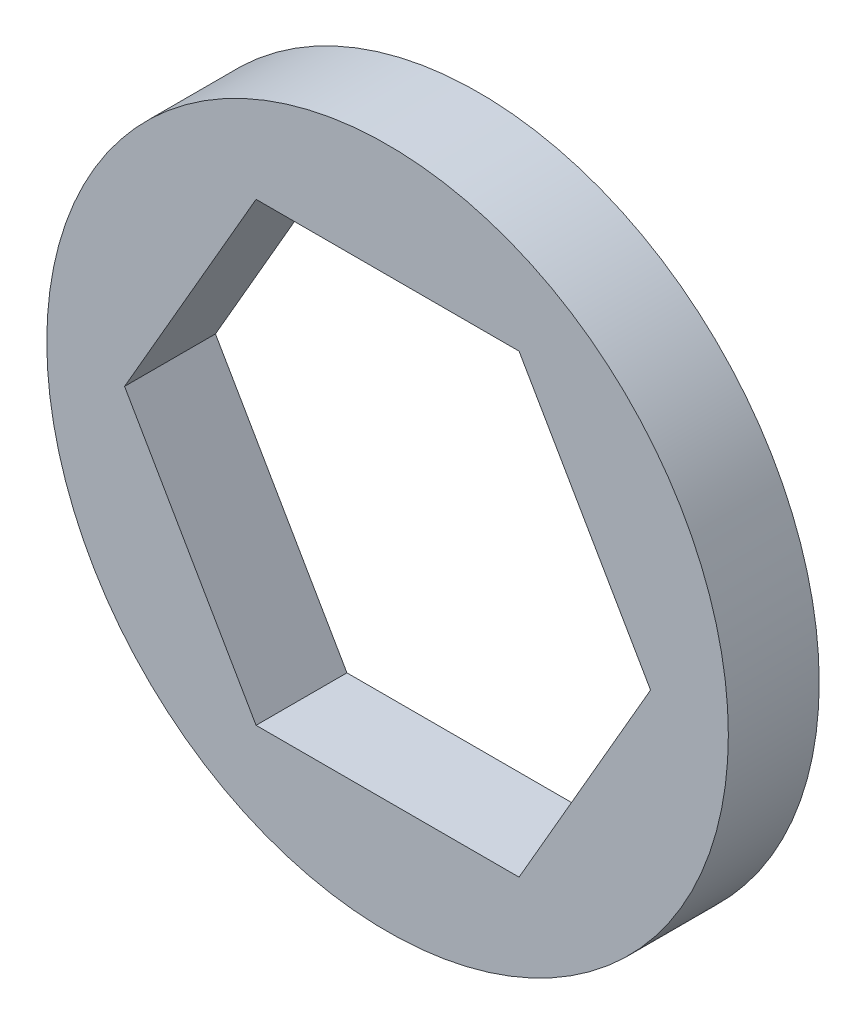
ISO-10303-21;
HEADER;
FILE_DESCRIPTION(('STEP AP214'),'2;1');
FILE_NAME('part.step','',(''),(''),'','','');
FILE_SCHEMA(('AUTOMOTIVE_DESIGN { 1 0 10303 214 1 1 1 1 }'));
ENDSEC;
DATA;
#1=APPLICATION_CONTEXT('core data for automotive mechanical design processes');
#2=APPLICATION_PROTOCOL_DEFINITION('international standard','automotive_design',2000,#1);
#3=PRODUCT_CONTEXT('',#1,'mechanical');
#4=PRODUCT('Part','Part','',(#3));
#5=PRODUCT_RELATED_PRODUCT_CATEGORY('part','',(#4));
#6=PRODUCT_DEFINITION_FORMATION('','',#4);
#7=PRODUCT_DEFINITION_CONTEXT('part definition',#1,'design');
#8=PRODUCT_DEFINITION('design','',#6,#7);
#9=PRODUCT_DEFINITION_SHAPE('','',#8);
#10=(LENGTH_UNIT() NAMED_UNIT(*) SI_UNIT(.MILLI.,.METRE.));
#11=(NAMED_UNIT(*) PLANE_ANGLE_UNIT() SI_UNIT($,.RADIAN.));
#12=(NAMED_UNIT(*) SI_UNIT($,.STERADIAN.) SOLID_ANGLE_UNIT());
#13=UNCERTAINTY_MEASURE_WITH_UNIT(LENGTH_MEASURE(1.E-05),#10,'distance_accuracy_value','');
#14=(GEOMETRIC_REPRESENTATION_CONTEXT(3) GLOBAL_UNCERTAINTY_ASSIGNED_CONTEXT((#13)) GLOBAL_UNIT_ASSIGNED_CONTEXT((#10,
#11,#12)) REPRESENTATION_CONTEXT('',''));
#15=CARTESIAN_POINT('',(0.,0.,0.));
#16=DIRECTION('',(0.,0.,1.));
#17=DIRECTION('',(1.,0.,0.));
#18=AXIS2_PLACEMENT_3D('',#15,#16,#17);
#19=CARTESIAN_POINT('',(0.,0.,1.));
#20=DIRECTION('',(0.,0.,1.));
#21=DIRECTION('',(1.,0.,0.));
#22=AXIS2_PLACEMENT_3D('',#19,#20,#21);
#23=PLANE('',#22);
#24=CARTESIAN_POINT('',(0.,0.,1.));
#25=DIRECTION('',(0.,0.,1.));
#26=DIRECTION('',(1.,0.,0.));
#27=AXIS2_PLACEMENT_3D('',#24,#25,#26);
#28=CIRCLE('',#27,7.5);
#29=CARTESIAN_POINT('',(7.5,0.,1.));
#30=VERTEX_POINT('',#29);
#31=EDGE_CURVE('E11',#30,#30,#28,.T.);
#32=ORIENTED_EDGE('',*,*,#31,.T.);
#33=EDGE_LOOP('',(#32));
#34=FACE_BOUND('',#33,.T.);
#35=DIRECTION('',(-0.5,0.866025403784438,0.));
#36=VECTOR('',#35,1.);
#37=CARTESIAN_POINT('',(5.787936448626,0.,1.));
#38=LINE('',#37,#36);
#39=CARTESIAN_POINT('',(5.787936448626,0.,1.));
#40=VERTEX_POINT('',#39);
#41=CARTESIAN_POINT('',(2.893968224313,5.0125,1.));
#42=VERTEX_POINT('',#41);
#43=EDGE_CURVE('E102',#40,#42,#38,.T.);
#44=ORIENTED_EDGE('',*,*,#43,.F.);
#45=DIRECTION('',(0.5,0.866025403784438,0.));
#46=VECTOR('',#45,1.);
#47=CARTESIAN_POINT('',(2.893968224313,-5.0125,1.));
#48=LINE('',#47,#46);
#49=CARTESIAN_POINT('',(2.893968224313,-5.0125,1.));
#50=VERTEX_POINT('',#49);
#51=EDGE_CURVE('E94',#50,#40,#48,.T.);
#52=ORIENTED_EDGE('',*,*,#51,.F.);
#53=DIRECTION('',(1.,0.,0.));
#54=VECTOR('',#53,1.);
#55=CARTESIAN_POINT('',(-2.893968224313,-5.0125,1.));
#56=LINE('',#55,#54);
#57=CARTESIAN_POINT('',(-2.893968224313,-5.0125,1.));
#58=VERTEX_POINT('',#57);
#59=EDGE_CURVE('E122',#58,#50,#56,.T.);
#60=ORIENTED_EDGE('',*,*,#59,.F.);
#61=DIRECTION('',(0.5,-0.866025403784439,0.));
#62=VECTOR('',#61,1.);
#63=CARTESIAN_POINT('',(-5.787936448626,0.,1.));
#64=LINE('',#63,#62);
#65=CARTESIAN_POINT('',(-5.787936448626,0.,1.));
#66=VERTEX_POINT('',#65);
#67=EDGE_CURVE('E120',#66,#58,#64,.T.);
#68=ORIENTED_EDGE('',*,*,#67,.F.);
#69=DIRECTION('',(-0.5,-0.866025403784438,0.));
#70=VECTOR('',#69,1.);
#71=CARTESIAN_POINT('',(-2.893968224313,5.0125,1.));
#72=LINE('',#71,#70);
#73=CARTESIAN_POINT('',(-2.893968224313,5.0125,1.));
#74=VERTEX_POINT('',#73);
#75=EDGE_CURVE('E116',#74,#66,#72,.T.);
#76=ORIENTED_EDGE('',*,*,#75,.F.);
#77=DIRECTION('',(-1.,0.,0.));
#78=VECTOR('',#77,1.);
#79=CARTESIAN_POINT('',(2.893968224313,5.0125,1.));
#80=LINE('',#79,#78);
#81=EDGE_CURVE('E114',#42,#74,#80,.T.);
#82=ORIENTED_EDGE('',*,*,#81,.F.);
#83=EDGE_LOOP('',(#44,#52,#60,#68,#76,#82));
#84=FACE_BOUND('',#83,.T.);
#85=ADVANCED_FACE('F41',(#34,#84),#23,.T.);
#86=CARTESIAN_POINT('',(0.,0.,-1.));
#87=DIRECTION('',(0.,0.,1.));
#88=DIRECTION('',(1.,0.,0.));
#89=AXIS2_PLACEMENT_3D('',#86,#87,#88);
#90=PLANE('',#89);
#91=CARTESIAN_POINT('',(0.,0.,-1.));
#92=DIRECTION('',(0.,0.,1.));
#93=DIRECTION('',(1.,0.,0.));
#94=AXIS2_PLACEMENT_3D('',#91,#92,#93);
#95=CIRCLE('',#94,7.5);
#96=CARTESIAN_POINT('',(7.5,0.,-1.));
#97=VERTEX_POINT('',#96);
#98=EDGE_CURVE('E45',#97,#97,#95,.T.);
#99=ORIENTED_EDGE('',*,*,#98,.F.);
#100=EDGE_LOOP('',(#99));
#101=FACE_BOUND('',#100,.T.);
#102=DIRECTION('',(0.5,0.866025403784438,0.));
#103=VECTOR('',#102,1.);
#104=CARTESIAN_POINT('',(2.893968224313,-5.0125,-1.));
#105=LINE('',#104,#103);
#106=CARTESIAN_POINT('',(2.893968224313,-5.0125,-1.));
#107=VERTEX_POINT('',#106);
#108=CARTESIAN_POINT('',(5.787936448626,0.,-1.));
#109=VERTEX_POINT('',#108);
#110=EDGE_CURVE('E64',#107,#109,#105,.T.);
#111=ORIENTED_EDGE('',*,*,#110,.T.);
#112=DIRECTION('',(-0.5,0.866025403784438,0.));
#113=VECTOR('',#112,1.);
#114=CARTESIAN_POINT('',(5.787936448626,0.,-1.));
#115=LINE('',#114,#113);
#116=CARTESIAN_POINT('',(2.893968224313,5.0125,-1.));
#117=VERTEX_POINT('',#116);
#118=EDGE_CURVE('E109',#109,#117,#115,.T.);
#119=ORIENTED_EDGE('',*,*,#118,.T.);
#120=DIRECTION('',(-1.,0.,0.));
#121=VECTOR('',#120,1.);
#122=CARTESIAN_POINT('',(2.893968224313,5.0125,-1.));
#123=LINE('',#122,#121);
#124=CARTESIAN_POINT('',(-2.893968224313,5.0125,-1.));
#125=VERTEX_POINT('',#124);
#126=EDGE_CURVE('E126',#117,#125,#123,.T.);
#127=ORIENTED_EDGE('',*,*,#126,.T.);
#128=DIRECTION('',(-0.5,-0.866025403784438,0.));
#129=VECTOR('',#128,1.);
#130=CARTESIAN_POINT('',(-2.893968224313,5.0125,-1.));
#131=LINE('',#130,#129);
#132=CARTESIAN_POINT('',(-5.787936448626,0.,-1.));
#133=VERTEX_POINT('',#132);
#134=EDGE_CURVE('E129',#125,#133,#131,.T.);
#135=ORIENTED_EDGE('',*,*,#134,.T.);
#136=DIRECTION('',(0.5,-0.866025403784439,0.));
#137=VECTOR('',#136,1.);
#138=CARTESIAN_POINT('',(-5.787936448626,0.,-1.));
#139=LINE('',#138,#137);
#140=CARTESIAN_POINT('',(-2.893968224313,-5.0125,-1.));
#141=VERTEX_POINT('',#140);
#142=EDGE_CURVE('E132',#133,#141,#139,.T.);
#143=ORIENTED_EDGE('',*,*,#142,.T.);
#144=DIRECTION('',(1.,0.,0.));
#145=VECTOR('',#144,1.);
#146=CARTESIAN_POINT('',(-2.893968224313,-5.0125,-1.));
#147=LINE('',#146,#145);
#148=EDGE_CURVE('E103',#141,#107,#147,.T.);
#149=ORIENTED_EDGE('',*,*,#148,.T.);
#150=EDGE_LOOP('',(#111,#119,#127,#135,#143,#149));
#151=FACE_BOUND('',#150,.T.);
#152=ADVANCED_FACE('F149',(#101,#151),#90,.F.);
#153=CARTESIAN_POINT('',(0.,0.,1.));
#154=DIRECTION('',(0.,0.,-1.));
#155=DIRECTION('',(-1.,0.,0.));
#156=AXIS2_PLACEMENT_3D('',#153,#154,#155);
#157=CYLINDRICAL_SURFACE('',#156,7.5);
#158=ORIENTED_EDGE('',*,*,#31,.F.);
#159=EDGE_LOOP('',(#158));
#160=FACE_BOUND('',#159,.T.);
#161=ORIENTED_EDGE('',*,*,#98,.T.);
#162=EDGE_LOOP('',(#161));
#163=FACE_BOUND('',#162,.T.);
#164=ADVANCED_FACE('F43',(#160,#163),#157,.T.);
#165=CARTESIAN_POINT('',(2.893968224313,-5.0125,1.));
#166=DIRECTION('',(-0.866025403784439,0.5,0.));
#167=DIRECTION('',(-0.5,-0.866025403784439,0.));
#168=AXIS2_PLACEMENT_3D('',#165,#166,#167);
#169=PLANE('',#168);
#170=ORIENTED_EDGE('',*,*,#110,.F.);
#171=DIRECTION('',(0.,0.,-1.));
#172=VECTOR('',#171,1.);
#173=CARTESIAN_POINT('',(2.893968224313,-5.0125,1.));
#174=LINE('',#173,#172);
#175=EDGE_CURVE('E98',#50,#107,#174,.T.);
#176=ORIENTED_EDGE('',*,*,#175,.F.);
#177=ORIENTED_EDGE('',*,*,#51,.T.);
#178=DIRECTION('',(0.,0.,-1.));
#179=VECTOR('',#178,1.);
#180=CARTESIAN_POINT('',(5.787936448626,0.,1.));
#181=LINE('',#180,#179);
#182=EDGE_CURVE('E97',#40,#109,#181,.T.);
#183=ORIENTED_EDGE('',*,*,#182,.T.);
#184=EDGE_LOOP('',(#170,#176,#177,#183));
#185=FACE_BOUND('',#184,.T.);
#186=ADVANCED_FACE('F96',(#185),#169,.T.);
#187=CARTESIAN_POINT('',(5.787936448626,0.,1.));
#188=DIRECTION('',(-0.866025403784438,-0.5,0.));
#189=DIRECTION('',(0.5,-0.866025403784439,0.));
#190=AXIS2_PLACEMENT_3D('',#187,#188,#189);
#191=PLANE('',#190);
#192=ORIENTED_EDGE('',*,*,#118,.F.);
#193=ORIENTED_EDGE('',*,*,#182,.F.);
#194=ORIENTED_EDGE('',*,*,#43,.T.);
#195=DIRECTION('',(0.,0.,-1.));
#196=VECTOR('',#195,1.);
#197=CARTESIAN_POINT('',(2.893968224313,5.0125,1.));
#198=LINE('',#197,#196);
#199=EDGE_CURVE('E110',#42,#117,#198,.T.);
#200=ORIENTED_EDGE('',*,*,#199,.T.);
#201=EDGE_LOOP('',(#192,#193,#194,#200));
#202=FACE_BOUND('',#201,.T.);
#203=ADVANCED_FACE('F106',(#202),#191,.T.);
#204=CARTESIAN_POINT('',(2.893968224313,5.0125,1.));
#205=DIRECTION('',(0.,-1.,0.));
#206=DIRECTION('',(1.,0.,0.));
#207=AXIS2_PLACEMENT_3D('',#204,#205,#206);
#208=PLANE('',#207);
#209=ORIENTED_EDGE('',*,*,#126,.F.);
#210=ORIENTED_EDGE('',*,*,#199,.F.);
#211=ORIENTED_EDGE('',*,*,#81,.T.);
#212=DIRECTION('',(0.,0.,-1.));
#213=VECTOR('',#212,1.);
#214=CARTESIAN_POINT('',(-2.893968224313,5.0125,1.));
#215=LINE('',#214,#213);
#216=EDGE_CURVE('E141',#74,#125,#215,.T.);
#217=ORIENTED_EDGE('',*,*,#216,.T.);
#218=EDGE_LOOP('',(#209,#210,#211,#217));
#219=FACE_BOUND('',#218,.T.);
#220=ADVANCED_FACE('F145',(#219),#208,.T.);
#221=CARTESIAN_POINT('',(-2.893968224313,5.0125,1.));
#222=DIRECTION('',(0.866025403784439,-0.5,0.));
#223=DIRECTION('',(0.5,0.866025403784439,0.));
#224=AXIS2_PLACEMENT_3D('',#221,#222,#223);
#225=PLANE('',#224);
#226=ORIENTED_EDGE('',*,*,#134,.F.);
#227=ORIENTED_EDGE('',*,*,#216,.F.);
#228=ORIENTED_EDGE('',*,*,#75,.T.);
#229=DIRECTION('',(0.,0.,-1.));
#230=VECTOR('',#229,1.);
#231=CARTESIAN_POINT('',(-5.787936448626,0.,1.));
#232=LINE('',#231,#230);
#233=EDGE_CURVE('E139',#66,#133,#232,.T.);
#234=ORIENTED_EDGE('',*,*,#233,.T.);
#235=EDGE_LOOP('',(#226,#227,#228,#234));
#236=FACE_BOUND('',#235,.T.);
#237=ADVANCED_FACE('F157',(#236),#225,.T.);
#238=CARTESIAN_POINT('',(-5.787936448626,0.,1.));
#239=DIRECTION('',(0.866025403784439,0.5,0.));
#240=DIRECTION('',(-0.5,0.866025403784439,0.));
#241=AXIS2_PLACEMENT_3D('',#238,#239,#240);
#242=PLANE('',#241);
#243=ORIENTED_EDGE('',*,*,#142,.F.);
#244=ORIENTED_EDGE('',*,*,#233,.F.);
#245=ORIENTED_EDGE('',*,*,#67,.T.);
#246=DIRECTION('',(0.,0.,-1.));
#247=VECTOR('',#246,1.);
#248=CARTESIAN_POINT('',(-2.893968224313,-5.0125,1.));
#249=LINE('',#248,#247);
#250=EDGE_CURVE('E56',#58,#141,#249,.T.);
#251=ORIENTED_EDGE('',*,*,#250,.T.);
#252=EDGE_LOOP('',(#243,#244,#245,#251));
#253=FACE_BOUND('',#252,.T.);
#254=ADVANCED_FACE('F155',(#253),#242,.T.);
#255=CARTESIAN_POINT('',(-2.893968224313,-5.0125,1.));
#256=DIRECTION('',(0.,1.,0.));
#257=DIRECTION('',(-1.,0.,0.));
#258=AXIS2_PLACEMENT_3D('',#255,#256,#257);
#259=PLANE('',#258);
#260=ORIENTED_EDGE('',*,*,#148,.F.);
#261=ORIENTED_EDGE('',*,*,#250,.F.);
#262=ORIENTED_EDGE('',*,*,#59,.T.);
#263=ORIENTED_EDGE('',*,*,#175,.T.);
#264=EDGE_LOOP('',(#260,#261,#262,#263));
#265=FACE_BOUND('',#264,.T.);
#266=ADVANCED_FACE('F151',(#265),#259,.T.);
#267=CLOSED_SHELL('',(#85,#152,#164,#186,#203,#220,#237,#254,#266));
#268=MANIFOLD_SOLID_BREP('B2',#267);
#269=ADVANCED_BREP_SHAPE_REPRESENTATION('',(#18,#268),#14);
#270=SHAPE_DEFINITION_REPRESENTATION(#9,#269);
ENDSEC;
END-ISO-10303-21;
